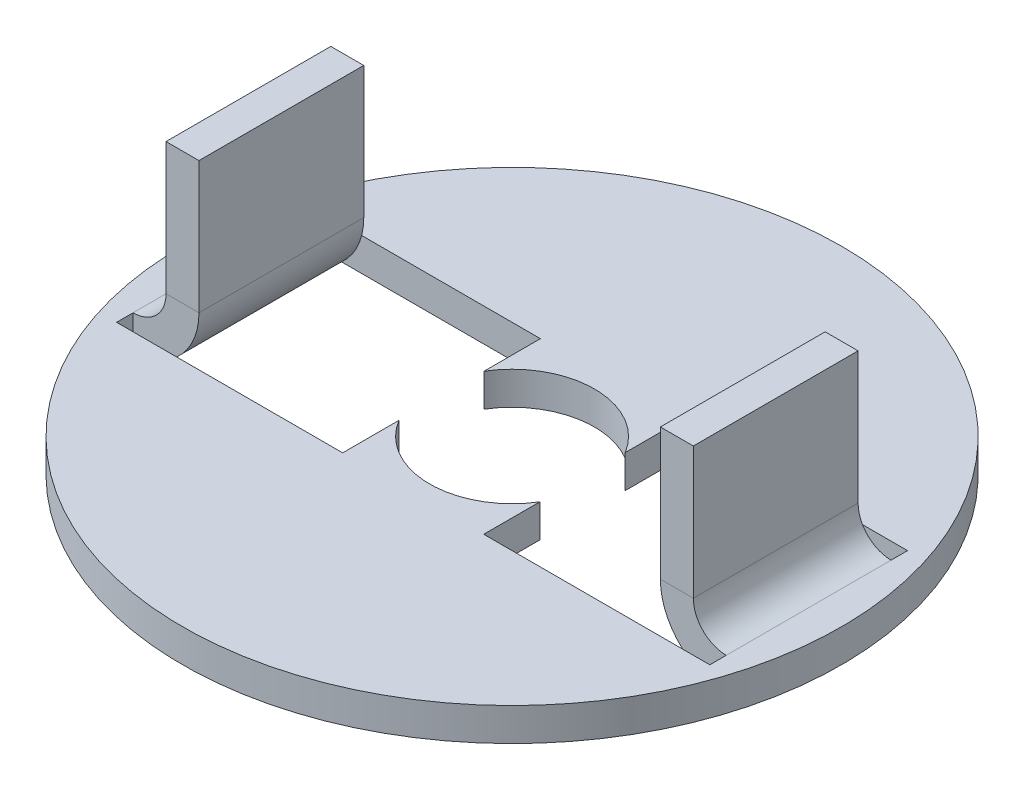
ISO-10303-21;
HEADER;
FILE_DESCRIPTION(('STEP AP214'),'2;1');
FILE_NAME('part.step','',(''),(''),'','','');
FILE_SCHEMA(('AUTOMOTIVE_DESIGN { 1 0 10303 214 1 1 1 1 }'));
ENDSEC;
DATA;
#1=APPLICATION_CONTEXT('core data for automotive mechanical design processes');
#2=APPLICATION_PROTOCOL_DEFINITION('international standard','automotive_design',2000,#1);
#3=PRODUCT_CONTEXT('',#1,'mechanical');
#4=PRODUCT('Part','Part','',(#3));
#5=PRODUCT_RELATED_PRODUCT_CATEGORY('part','',(#4));
#6=PRODUCT_DEFINITION_FORMATION('','',#4);
#7=PRODUCT_DEFINITION_CONTEXT('part definition',#1,'design');
#8=PRODUCT_DEFINITION('design','',#6,#7);
#9=PRODUCT_DEFINITION_SHAPE('','',#8);
#10=(LENGTH_UNIT() NAMED_UNIT(*) SI_UNIT(.MILLI.,.METRE.));
#11=(NAMED_UNIT(*) PLANE_ANGLE_UNIT() SI_UNIT($,.RADIAN.));
#12=(NAMED_UNIT(*) SI_UNIT($,.STERADIAN.) SOLID_ANGLE_UNIT());
#13=UNCERTAINTY_MEASURE_WITH_UNIT(LENGTH_MEASURE(1.E-05),#10,'distance_accuracy_value','');
#14=(GEOMETRIC_REPRESENTATION_CONTEXT(3) GLOBAL_UNCERTAINTY_ASSIGNED_CONTEXT((#13)) GLOBAL_UNIT_ASSIGNED_CONTEXT((#10,
#11,#12)) REPRESENTATION_CONTEXT('',''));
#15=CARTESIAN_POINT('',(0.,0.,0.));
#16=DIRECTION('',(0.,0.,1.));
#17=DIRECTION('',(1.,0.,0.));
#18=AXIS2_PLACEMENT_3D('',#15,#16,#17);
#19=CARTESIAN_POINT('',(-8.,0.999999999999999,2.5));
#20=DIRECTION('',(0.,0.,1.));
#21=DIRECTION('',(1.,0.,0.));
#22=AXIS2_PLACEMENT_3D('',#19,#20,#21);
#23=PLANE('',#22);
#24=DIRECTION('',(1.,0.,0.));
#25=VECTOR('',#24,1.);
#26=CARTESIAN_POINT('',(-8.,0.999999999999999,2.5));
#27=LINE('',#26,#25);
#28=CARTESIAN_POINT('',(-8.,0.999999999999999,2.5));
#29=VERTEX_POINT('',#28);
#30=CARTESIAN_POINT('',(-7.,0.999999999999999,2.5));
#31=VERTEX_POINT('',#30);
#32=EDGE_CURVE('E11',#29,#31,#27,.T.);
#33=ORIENTED_EDGE('',*,*,#32,.F.);
#34=CARTESIAN_POINT('',(-9.,0.999999999999999,2.5));
#35=DIRECTION('',(0.,0.,1.));
#36=DIRECTION('',(1.,0.,0.));
#37=AXIS2_PLACEMENT_3D('',#34,#35,#36);
#38=CIRCLE('',#37,1.);
#39=CARTESIAN_POINT('',(-9.,0.,2.5));
#40=VERTEX_POINT('',#39);
#41=EDGE_CURVE('E416',#29,#40,#38,.F.);
#42=ORIENTED_EDGE('',*,*,#41,.T.);
#43=DIRECTION('',(0.,1.,0.));
#44=VECTOR('',#43,1.);
#45=CARTESIAN_POINT('',(-9.,-1.,2.5));
#46=LINE('',#45,#44);
#47=CARTESIAN_POINT('',(-9.,-0.999999999999999,2.5));
#48=VERTEX_POINT('',#47);
#49=EDGE_CURVE('E49',#48,#40,#46,.T.);
#50=ORIENTED_EDGE('',*,*,#49,.F.);
#51=CARTESIAN_POINT('',(-9.,0.999999999999999,2.5));
#52=DIRECTION('',(0.,0.,1.));
#53=DIRECTION('',(1.,0.,0.));
#54=AXIS2_PLACEMENT_3D('',#51,#52,#53);
#55=CIRCLE('',#54,2.);
#56=EDGE_CURVE('E404',#31,#48,#55,.F.);
#57=ORIENTED_EDGE('',*,*,#56,.F.);
#58=EDGE_LOOP('',(#33,#42,#50,#57));
#59=FACE_BOUND('',#58,.T.);
#60=ADVANCED_FACE('F41',(#59),#23,.T.);
#61=CARTESIAN_POINT('',(-9.,-1.,2.5));
#62=DIRECTION('',(0.,0.,1.));
#63=DIRECTION('',(1.,0.,0.));
#64=AXIS2_PLACEMENT_3D('',#61,#62,#63);
#65=PLANE('',#64);
#66=DIRECTION('',(0.,-1.,0.));
#67=VECTOR('',#66,1.);
#68=CARTESIAN_POINT('',(-8.,5.,2.5));
#69=LINE('',#68,#67);
#70=CARTESIAN_POINT('',(-8.,5.,2.5));
#71=VERTEX_POINT('',#70);
#72=EDGE_CURVE('E414',#71,#29,#69,.T.);
#73=ORIENTED_EDGE('',*,*,#72,.T.);
#74=ORIENTED_EDGE('',*,*,#32,.T.);
#75=DIRECTION('',(0.,1.,0.));
#76=VECTOR('',#75,1.);
#77=CARTESIAN_POINT('',(-7.,5.,2.5));
#78=LINE('',#77,#76);
#79=CARTESIAN_POINT('',(-7.,5.,2.5));
#80=VERTEX_POINT('',#79);
#81=EDGE_CURVE('E407',#80,#31,#78,.F.);
#82=ORIENTED_EDGE('',*,*,#81,.F.);
#83=DIRECTION('',(1.,0.,0.));
#84=VECTOR('',#83,1.);
#85=CARTESIAN_POINT('',(-8.,5.,2.5));
#86=LINE('',#85,#84);
#87=EDGE_CURVE('E411',#71,#80,#86,.T.);
#88=ORIENTED_EDGE('',*,*,#87,.F.);
#89=EDGE_LOOP('',(#73,#74,#82,#88));
#90=FACE_BOUND('',#89,.T.);
#91=ADVANCED_FACE('F470',(#90),#65,.T.);
#92=CARTESIAN_POINT('',(-9.,0.,-2.5));
#93=DIRECTION('',(0.,0.,-1.));
#94=DIRECTION('',(-1.,0.,0.));
#95=AXIS2_PLACEMENT_3D('',#92,#93,#94);
#96=PLANE('',#95);
#97=DIRECTION('',(0.,-1.,0.));
#98=VECTOR('',#97,1.);
#99=CARTESIAN_POINT('',(-9.,0.,-2.5));
#100=LINE('',#99,#98);
#101=CARTESIAN_POINT('',(-9.,0.,-2.5));
#102=VERTEX_POINT('',#101);
#103=CARTESIAN_POINT('',(-9.,-1.,-2.5));
#104=VERTEX_POINT('',#103);
#105=EDGE_CURVE('E87',#102,#104,#100,.T.);
#106=ORIENTED_EDGE('',*,*,#105,.F.);
#107=CARTESIAN_POINT('',(-9.,0.999999999999999,-2.5));
#108=DIRECTION('',(0.,0.,1.));
#109=DIRECTION('',(1.,0.,0.));
#110=AXIS2_PLACEMENT_3D('',#107,#108,#109);
#111=CIRCLE('',#110,1.);
#112=CARTESIAN_POINT('',(-8.,0.999999999999999,-2.5));
#113=VERTEX_POINT('',#112);
#114=EDGE_CURVE('E408',#113,#102,#111,.F.);
#115=ORIENTED_EDGE('',*,*,#114,.F.);
#116=DIRECTION('',(-1.,0.,0.));
#117=VECTOR('',#116,1.);
#118=CARTESIAN_POINT('',(-7.,0.999999999999999,-2.5));
#119=LINE('',#118,#117);
#120=CARTESIAN_POINT('',(-7.,0.999999999999999,-2.5));
#121=VERTEX_POINT('',#120);
#122=EDGE_CURVE('E79',#121,#113,#119,.T.);
#123=ORIENTED_EDGE('',*,*,#122,.F.);
#124=CARTESIAN_POINT('',(-9.,0.999999999999999,-2.5));
#125=DIRECTION('',(0.,0.,1.));
#126=DIRECTION('',(1.,0.,0.));
#127=AXIS2_PLACEMENT_3D('',#124,#125,#126);
#128=CIRCLE('',#127,2.);
#129=EDGE_CURVE('E393',#121,#104,#128,.F.);
#130=ORIENTED_EDGE('',*,*,#129,.T.);
#131=EDGE_LOOP('',(#106,#115,#123,#130));
#132=FACE_BOUND('',#131,.T.);
#133=ADVANCED_FACE('F457',(#132),#96,.T.);
#134=CARTESIAN_POINT('',(-8.,0.,2.5));
#135=DIRECTION('',(0.,-1.,0.));
#136=DIRECTION('',(1.,0.,0.));
#137=AXIS2_PLACEMENT_3D('',#134,#135,#136);
#138=PLANE('',#137);
#139=CARTESIAN_POINT('',(0.,0.,0.));
#140=DIRECTION('',(0.,-1.,0.));
#141=DIRECTION('',(0.,0.,-1.));
#142=AXIS2_PLACEMENT_3D('',#139,#140,#141);
#143=CIRCLE('',#142,10.);
#144=CARTESIAN_POINT('',(0.,0.,-10.));
#145=VERTEX_POINT('',#144);
#146=EDGE_CURVE('E229',#145,#145,#143,.T.);
#147=ORIENTED_EDGE('',*,*,#146,.F.);
#148=EDGE_LOOP('',(#147));
#149=FACE_BOUND('',#148,.T.);
#150=DIRECTION('',(0.,0.,-1.));
#151=VECTOR('',#150,1.);
#152=CARTESIAN_POINT('',(2.13999999999996,0.,3.00000000000003));
#153=LINE('',#152,#151);
#154=CARTESIAN_POINT('',(2.13999999999996,0.,3.00000000000003));
#155=VERTEX_POINT('',#154);
#156=CARTESIAN_POINT('',(2.13999999999998,0.,1.29243955371231));
#157=VERTEX_POINT('',#156);
#158=EDGE_CURVE('E241',#155,#157,#153,.T.);
#159=ORIENTED_EDGE('',*,*,#158,.T.);
#160=CARTESIAN_POINT('',(0.,0.,0.));
#161=DIRECTION('',(0.,1.,0.));
#162=DIRECTION('',(0.,0.,-1.));
#163=AXIS2_PLACEMENT_3D('',#160,#161,#162);
#164=CIRCLE('',#163,2.5);
#165=CARTESIAN_POINT('',(-2.14,0.,1.29243955371228));
#166=VERTEX_POINT('',#165);
#167=EDGE_CURVE('E366',#166,#157,#164,.T.);
#168=ORIENTED_EDGE('',*,*,#167,.F.);
#169=DIRECTION('',(0.,0.,-1.));
#170=VECTOR('',#169,1.);
#171=CARTESIAN_POINT('',(-2.14,0.,3.));
#172=LINE('',#171,#170);
#173=CARTESIAN_POINT('',(-2.14,0.,3.));
#174=VERTEX_POINT('',#173);
#175=EDGE_CURVE('E363',#174,#166,#172,.T.);
#176=ORIENTED_EDGE('',*,*,#175,.F.);
#177=DIRECTION('',(1.,0.,0.));
#178=VECTOR('',#177,1.);
#179=CARTESIAN_POINT('',(-9.,0.,3.));
#180=LINE('',#179,#178);
#181=CARTESIAN_POINT('',(-9.,0.,3.));
#182=VERTEX_POINT('',#181);
#183=EDGE_CURVE('E360',#182,#174,#180,.T.);
#184=ORIENTED_EDGE('',*,*,#183,.F.);
#185=DIRECTION('',(0.,0.,1.));
#186=VECTOR('',#185,1.);
#187=CARTESIAN_POINT('',(-9.,0.,3.));
#188=LINE('',#187,#186);
#189=EDGE_CURVE('E356',#40,#182,#188,.T.);
#190=ORIENTED_EDGE('',*,*,#189,.F.);
#191=DIRECTION('',(0.,0.,-1.));
#192=VECTOR('',#191,1.);
#193=CARTESIAN_POINT('',(-9.,0.,2.5));
#194=LINE('',#193,#192);
#195=EDGE_CURVE('E418',#40,#102,#194,.T.);
#196=ORIENTED_EDGE('',*,*,#195,.T.);
#197=CARTESIAN_POINT('',(-9.,0.,-3.));
#198=VERTEX_POINT('',#197);
#199=EDGE_CURVE('E357',#198,#102,#188,.T.);
#200=ORIENTED_EDGE('',*,*,#199,.F.);
#201=DIRECTION('',(-1.,0.,0.));
#202=VECTOR('',#201,1.);
#203=CARTESIAN_POINT('',(-9.,0.,-3.));
#204=LINE('',#203,#202);
#205=CARTESIAN_POINT('',(-2.14,0.,-3.));
#206=VERTEX_POINT('',#205);
#207=EDGE_CURVE('E353',#206,#198,#204,.T.);
#208=ORIENTED_EDGE('',*,*,#207,.F.);
#209=DIRECTION('',(0.,0.,-1.));
#210=VECTOR('',#209,1.);
#211=CARTESIAN_POINT('',(-2.14,0.,-1.29243955371228));
#212=LINE('',#211,#210);
#213=CARTESIAN_POINT('',(-2.14,0.,-1.29243955371228));
#214=VERTEX_POINT('',#213);
#215=EDGE_CURVE('E226',#214,#206,#212,.T.);
#216=ORIENTED_EDGE('',*,*,#215,.F.);
#217=CARTESIAN_POINT('',(0.,0.,0.));
#218=DIRECTION('',(0.,1.,0.));
#219=DIRECTION('',(0.,0.,-1.));
#220=AXIS2_PLACEMENT_3D('',#217,#218,#219);
#221=CIRCLE('',#220,2.5);
#222=CARTESIAN_POINT('',(2.14000000000002,0.,-1.29243955371225));
#223=VERTEX_POINT('',#222);
#224=EDGE_CURVE('E217',#223,#214,#221,.T.);
#225=ORIENTED_EDGE('',*,*,#224,.F.);
#226=DIRECTION('',(0.,0.,-1.));
#227=VECTOR('',#226,1.);
#228=CARTESIAN_POINT('',(2.14000000000002,0.,-1.29243955371225));
#229=LINE('',#228,#227);
#230=CARTESIAN_POINT('',(2.14000000000004,0.,-2.99999999999997));
#231=VERTEX_POINT('',#230);
#232=EDGE_CURVE('E223',#223,#231,#229,.T.);
#233=ORIENTED_EDGE('',*,*,#232,.T.);
#234=DIRECTION('',(1.,0.,0.));
#235=VECTOR('',#234,1.);
#236=CARTESIAN_POINT('',(9.00000000000004,0.,-2.99999999999987));
#237=LINE('',#236,#235);
#238=CARTESIAN_POINT('',(9.00000000000004,0.,-2.99999999999987));
#239=VERTEX_POINT('',#238);
#240=EDGE_CURVE('E246',#231,#239,#237,.T.);
#241=ORIENTED_EDGE('',*,*,#240,.T.);
#242=DIRECTION('',(0.,0.,1.));
#243=VECTOR('',#242,1.);
#244=CARTESIAN_POINT('',(8.99999999999996,0.,3.00000000000012));
#245=LINE('',#244,#243);
#246=CARTESIAN_POINT('',(9.00000000000003,0.,-2.49999999999987));
#247=VERTEX_POINT('',#246);
#248=EDGE_CURVE('E257',#239,#247,#245,.T.);
#249=ORIENTED_EDGE('',*,*,#248,.T.);
#250=DIRECTION('',(0.,0.,-1.));
#251=VECTOR('',#250,1.);
#252=CARTESIAN_POINT('',(8.99999999999996,0.,2.50000000000013));
#253=LINE('',#252,#251);
#254=CARTESIAN_POINT('',(8.99999999999997,0.,2.50000000000013));
#255=VERTEX_POINT('',#254);
#256=EDGE_CURVE('E309',#255,#247,#253,.T.);
#257=ORIENTED_EDGE('',*,*,#256,.F.);
#258=CARTESIAN_POINT('',(8.99999999999996,0.,3.00000000000012));
#259=VERTEX_POINT('',#258);
#260=EDGE_CURVE('E250',#255,#259,#245,.T.);
#261=ORIENTED_EDGE('',*,*,#260,.T.);
#262=DIRECTION('',(-1.,0.,0.));
#263=VECTOR('',#262,1.);
#264=CARTESIAN_POINT('',(8.99999999999996,0.,3.00000000000012));
#265=LINE('',#264,#263);
#266=EDGE_CURVE('E260',#259,#155,#265,.T.);
#267=ORIENTED_EDGE('',*,*,#266,.T.);
#268=EDGE_LOOP('',(#159,#168,#176,#184,#190,#196,#200,#208,#216,#225,#233,#241,#249,#257,#261,#267));
#269=FACE_BOUND('',#268,.T.);
#270=ADVANCED_FACE('F220',(#149,#269),#138,.F.);
#271=CARTESIAN_POINT('',(-8.,-1.,2.5));
#272=DIRECTION('',(0.,-1.,0.));
#273=DIRECTION('',(1.,0.,0.));
#274=AXIS2_PLACEMENT_3D('',#271,#272,#273);
#275=PLANE('',#274);
#276=CARTESIAN_POINT('',(0.,-0.999999999999999,0.));
#277=DIRECTION('',(0.,-1.,0.));
#278=DIRECTION('',(0.,0.,-1.));
#279=AXIS2_PLACEMENT_3D('',#276,#277,#278);
#280=CIRCLE('',#279,10.);
#281=CARTESIAN_POINT('',(0.,-0.999999999999999,-10.));
#282=VERTEX_POINT('',#281);
#283=EDGE_CURVE('E348',#282,#282,#280,.T.);
#284=ORIENTED_EDGE('',*,*,#283,.T.);
#285=EDGE_LOOP('',(#284));
#286=FACE_BOUND('',#285,.T.);
#287=CARTESIAN_POINT('',(0.,-0.999999999999999,0.));
#288=DIRECTION('',(0.,1.,0.));
#289=DIRECTION('',(0.,0.,-1.));
#290=AXIS2_PLACEMENT_3D('',#287,#288,#289);
#291=CIRCLE('',#290,2.5);
#292=CARTESIAN_POINT('',(-2.14,-0.999999999999999,1.29243955371228));
#293=VERTEX_POINT('',#292);
#294=CARTESIAN_POINT('',(2.13999999999998,-0.999999999999999,1.29243955371231));
#295=VERTEX_POINT('',#294);
#296=EDGE_CURVE('E350',#293,#295,#291,.T.);
#297=ORIENTED_EDGE('',*,*,#296,.T.);
#298=DIRECTION('',(0.,0.,-1.));
#299=VECTOR('',#298,1.);
#300=CARTESIAN_POINT('',(2.13999999999996,-0.999999999999999,3.00000000000003));
#301=LINE('',#300,#299);
#302=CARTESIAN_POINT('',(2.13999999999996,-0.999999999999999,3.00000000000003));
#303=VERTEX_POINT('',#302);
#304=EDGE_CURVE('E247',#303,#295,#301,.T.);
#305=ORIENTED_EDGE('',*,*,#304,.F.);
#306=DIRECTION('',(-1.,0.,0.));
#307=VECTOR('',#306,1.);
#308=CARTESIAN_POINT('',(8.99999999999996,-0.999999999999999,3.00000000000012));
#309=LINE('',#308,#307);
#310=CARTESIAN_POINT('',(8.99999999999996,-0.999999999999999,3.00000000000012));
#311=VERTEX_POINT('',#310);
#312=EDGE_CURVE('E254',#311,#303,#309,.T.);
#313=ORIENTED_EDGE('',*,*,#312,.F.);
#314=DIRECTION('',(0.,0.,1.));
#315=VECTOR('',#314,1.);
#316=CARTESIAN_POINT('',(8.99999999999996,-0.999999999999999,3.00000000000012));
#317=LINE('',#316,#315);
#318=CARTESIAN_POINT('',(8.99999999999997,-0.999999999999999,2.50000000000013));
#319=VERTEX_POINT('',#318);
#320=EDGE_CURVE('E273',#319,#311,#317,.T.);
#321=ORIENTED_EDGE('',*,*,#320,.F.);
#322=DIRECTION('',(0.,0.,-1.));
#323=VECTOR('',#322,1.);
#324=CARTESIAN_POINT('',(8.99999999999996,-1.,2.50000000000013));
#325=LINE('',#324,#323);
#326=CARTESIAN_POINT('',(9.00000000000003,-1.,-2.49999999999987));
#327=VERTEX_POINT('',#326);
#328=EDGE_CURVE('E333',#319,#327,#325,.T.);
#329=ORIENTED_EDGE('',*,*,#328,.T.);
#330=CARTESIAN_POINT('',(9.00000000000004,-0.999999999999999,-2.99999999999987));
#331=VERTEX_POINT('',#330);
#332=EDGE_CURVE('E274',#331,#327,#317,.T.);
#333=ORIENTED_EDGE('',*,*,#332,.F.);
#334=DIRECTION('',(1.,0.,0.));
#335=VECTOR('',#334,1.);
#336=CARTESIAN_POINT('',(9.00000000000004,-0.999999999999999,-2.99999999999987));
#337=LINE('',#336,#335);
#338=CARTESIAN_POINT('',(2.14000000000004,-0.999999999999999,-2.99999999999997));
#339=VERTEX_POINT('',#338);
#340=EDGE_CURVE('E269',#339,#331,#337,.T.);
#341=ORIENTED_EDGE('',*,*,#340,.F.);
#342=DIRECTION('',(0.,0.,-1.));
#343=VECTOR('',#342,1.);
#344=CARTESIAN_POINT('',(2.14000000000002,-0.999999999999999,-1.29243955371225));
#345=LINE('',#344,#343);
#346=CARTESIAN_POINT('',(2.14000000000002,-0.999999999999999,-1.29243955371225));
#347=VERTEX_POINT('',#346);
#348=EDGE_CURVE('E266',#347,#339,#345,.T.);
#349=ORIENTED_EDGE('',*,*,#348,.F.);
#350=CARTESIAN_POINT('',(0.,-0.999999999999999,0.));
#351=DIRECTION('',(0.,1.,0.));
#352=DIRECTION('',(0.,0.,-1.));
#353=AXIS2_PLACEMENT_3D('',#350,#351,#352);
#354=CIRCLE('',#353,2.5);
#355=CARTESIAN_POINT('',(-2.14,-0.999999999999999,-1.29243955371228));
#356=VERTEX_POINT('',#355);
#357=EDGE_CURVE('E235',#347,#356,#354,.T.);
#358=ORIENTED_EDGE('',*,*,#357,.T.);
#359=DIRECTION('',(0.,0.,-1.));
#360=VECTOR('',#359,1.);
#361=CARTESIAN_POINT('',(-2.14,-0.999999999999999,-1.29243955371228));
#362=LINE('',#361,#360);
#363=CARTESIAN_POINT('',(-2.14,-0.999999999999999,-3.));
#364=VERTEX_POINT('',#363);
#365=EDGE_CURVE('E374',#356,#364,#362,.T.);
#366=ORIENTED_EDGE('',*,*,#365,.T.);
#367=DIRECTION('',(-1.,0.,0.));
#368=VECTOR('',#367,1.);
#369=CARTESIAN_POINT('',(-9.,-0.999999999999999,-3.));
#370=LINE('',#369,#368);
#371=CARTESIAN_POINT('',(-9.,-0.999999999999999,-3.));
#372=VERTEX_POINT('',#371);
#373=EDGE_CURVE('E377',#364,#372,#370,.T.);
#374=ORIENTED_EDGE('',*,*,#373,.T.);
#375=DIRECTION('',(0.,0.,1.));
#376=VECTOR('',#375,1.);
#377=CARTESIAN_POINT('',(-9.,-0.999999999999999,3.));
#378=LINE('',#377,#376);
#379=EDGE_CURVE('E381',#372,#104,#378,.T.);
#380=ORIENTED_EDGE('',*,*,#379,.T.);
#381=DIRECTION('',(0.,0.,-1.));
#382=VECTOR('',#381,1.);
#383=CARTESIAN_POINT('',(-9.,-1.,2.5));
#384=LINE('',#383,#382);
#385=EDGE_CURVE('E440',#48,#104,#384,.T.);
#386=ORIENTED_EDGE('',*,*,#385,.F.);
#387=CARTESIAN_POINT('',(-9.,-0.999999999999999,3.));
#388=VERTEX_POINT('',#387);
#389=EDGE_CURVE('E380',#48,#388,#378,.T.);
#390=ORIENTED_EDGE('',*,*,#389,.T.);
#391=DIRECTION('',(1.,0.,0.));
#392=VECTOR('',#391,1.);
#393=CARTESIAN_POINT('',(-9.,-0.999999999999999,3.));
#394=LINE('',#393,#392);
#395=CARTESIAN_POINT('',(-2.14,-0.999999999999999,3.));
#396=VERTEX_POINT('',#395);
#397=EDGE_CURVE('E384',#388,#396,#394,.T.);
#398=ORIENTED_EDGE('',*,*,#397,.T.);
#399=DIRECTION('',(0.,0.,-1.));
#400=VECTOR('',#399,1.);
#401=CARTESIAN_POINT('',(-2.14,-0.999999999999999,3.));
#402=LINE('',#401,#400);
#403=EDGE_CURVE('E387',#396,#293,#402,.T.);
#404=ORIENTED_EDGE('',*,*,#403,.T.);
#405=EDGE_LOOP('',(#297,#305,#313,#321,#329,#333,#341,#349,#358,#366,#374,#380,#386,#390,#398,#404));
#406=FACE_BOUND('',#405,.T.);
#407=ADVANCED_FACE('F492',(#286,#406),#275,.T.);
#408=CARTESIAN_POINT('',(-9.,0.999999999999999,2.5));
#409=DIRECTION('',(0.,0.,-1.));
#410=DIRECTION('',(-1.,0.,0.));
#411=AXIS2_PLACEMENT_3D('',#408,#409,#410);
#412=CYLINDRICAL_SURFACE('',#411,2.);
#413=ORIENTED_EDGE('',*,*,#129,.F.);
#414=DIRECTION('',(0.,0.,-1.));
#415=VECTOR('',#414,1.);
#416=CARTESIAN_POINT('',(-7.,0.999999999999999,2.5));
#417=LINE('',#416,#415);
#418=EDGE_CURVE('E437',#31,#121,#417,.T.);
#419=ORIENTED_EDGE('',*,*,#418,.F.);
#420=ORIENTED_EDGE('',*,*,#56,.T.);
#421=ORIENTED_EDGE('',*,*,#385,.T.);
#422=EDGE_LOOP('',(#413,#419,#420,#421));
#423=FACE_BOUND('',#422,.T.);
#424=ADVANCED_FACE('F463',(#423),#412,.T.);
#425=CARTESIAN_POINT('',(-7.,5.,2.5));
#426=DIRECTION('',(1.,0.,0.));
#427=DIRECTION('',(0.,0.,-1.));
#428=AXIS2_PLACEMENT_3D('',#425,#426,#427);
#429=PLANE('',#428);
#430=DIRECTION('',(0.,1.,0.));
#431=VECTOR('',#430,1.);
#432=CARTESIAN_POINT('',(-7.,5.,-2.5));
#433=LINE('',#432,#431);
#434=CARTESIAN_POINT('',(-7.,5.,-2.5));
#435=VERTEX_POINT('',#434);
#436=EDGE_CURVE('E420',#435,#121,#433,.F.);
#437=ORIENTED_EDGE('',*,*,#436,.F.);
#438=DIRECTION('',(0.,0.,-1.));
#439=VECTOR('',#438,1.);
#440=CARTESIAN_POINT('',(-7.,5.,2.5));
#441=LINE('',#440,#439);
#442=EDGE_CURVE('E435',#80,#435,#441,.T.);
#443=ORIENTED_EDGE('',*,*,#442,.F.);
#444=ORIENTED_EDGE('',*,*,#81,.T.);
#445=ORIENTED_EDGE('',*,*,#418,.T.);
#446=EDGE_LOOP('',(#437,#443,#444,#445));
#447=FACE_BOUND('',#446,.T.);
#448=ADVANCED_FACE('F461',(#447),#429,.T.);
#449=CARTESIAN_POINT('',(-8.,5.,2.5));
#450=DIRECTION('',(0.,1.,0.));
#451=DIRECTION('',(0.,0.,1.));
#452=AXIS2_PLACEMENT_3D('',#449,#450,#451);
#453=PLANE('',#452);
#454=DIRECTION('',(1.,0.,0.));
#455=VECTOR('',#454,1.);
#456=CARTESIAN_POINT('',(-8.,5.,-2.5));
#457=LINE('',#456,#455);
#458=CARTESIAN_POINT('',(-8.,5.,-2.5));
#459=VERTEX_POINT('',#458);
#460=EDGE_CURVE('E422',#459,#435,#457,.T.);
#461=ORIENTED_EDGE('',*,*,#460,.F.);
#462=DIRECTION('',(0.,0.,-1.));
#463=VECTOR('',#462,1.);
#464=CARTESIAN_POINT('',(-8.,5.,2.5));
#465=LINE('',#464,#463);
#466=EDGE_CURVE('E433',#71,#459,#465,.T.);
#467=ORIENTED_EDGE('',*,*,#466,.F.);
#468=ORIENTED_EDGE('',*,*,#87,.T.);
#469=ORIENTED_EDGE('',*,*,#442,.T.);
#470=EDGE_LOOP('',(#461,#467,#468,#469));
#471=FACE_BOUND('',#470,.T.);
#472=ADVANCED_FACE('F467',(#471),#453,.T.);
#473=CARTESIAN_POINT('',(-8.,5.,2.5));
#474=DIRECTION('',(1.,0.,0.));
#475=DIRECTION('',(0.,0.,-1.));
#476=AXIS2_PLACEMENT_3D('',#473,#474,#475);
#477=PLANE('',#476);
#478=DIRECTION('',(0.,-1.,0.));
#479=VECTOR('',#478,1.);
#480=CARTESIAN_POINT('',(-8.,5.,-2.5));
#481=LINE('',#480,#479);
#482=EDGE_CURVE('E425',#459,#113,#481,.T.);
#483=ORIENTED_EDGE('',*,*,#482,.T.);
#484=DIRECTION('',(0.,0.,-1.));
#485=VECTOR('',#484,1.);
#486=CARTESIAN_POINT('',(-8.,0.999999999999999,2.5));
#487=LINE('',#486,#485);
#488=EDGE_CURVE('E430',#29,#113,#487,.T.);
#489=ORIENTED_EDGE('',*,*,#488,.F.);
#490=ORIENTED_EDGE('',*,*,#72,.F.);
#491=ORIENTED_EDGE('',*,*,#466,.T.);
#492=EDGE_LOOP('',(#483,#489,#490,#491));
#493=FACE_BOUND('',#492,.T.);
#494=ADVANCED_FACE('F472',(#493),#477,.F.);
#495=CARTESIAN_POINT('',(-9.,0.999999999999999,2.5));
#496=DIRECTION('',(0.,0.,-1.));
#497=DIRECTION('',(-1.,0.,0.));
#498=AXIS2_PLACEMENT_3D('',#495,#496,#497);
#499=CYLINDRICAL_SURFACE('',#498,1.);
#500=ORIENTED_EDGE('',*,*,#114,.T.);
#501=ORIENTED_EDGE('',*,*,#195,.F.);
#502=ORIENTED_EDGE('',*,*,#41,.F.);
#503=ORIENTED_EDGE('',*,*,#488,.T.);
#504=EDGE_LOOP('',(#500,#501,#502,#503));
#505=FACE_BOUND('',#504,.T.);
#506=ADVANCED_FACE('F455',(#505),#499,.F.);
#507=CARTESIAN_POINT('',(-9.,0.999999999999999,-2.5));
#508=DIRECTION('',(0.,0.,1.));
#509=DIRECTION('',(1.,0.,0.));
#510=AXIS2_PLACEMENT_3D('',#507,#508,#509);
#511=PLANE('',#510);
#512=ORIENTED_EDGE('',*,*,#436,.T.);
#513=ORIENTED_EDGE('',*,*,#122,.T.);
#514=ORIENTED_EDGE('',*,*,#482,.F.);
#515=ORIENTED_EDGE('',*,*,#460,.T.);
#516=EDGE_LOOP('',(#512,#513,#514,#515));
#517=FACE_BOUND('',#516,.T.);
#518=ADVANCED_FACE('F464',(#517),#511,.F.);
#519=CARTESIAN_POINT('',(0.,0.,0.));
#520=DIRECTION('',(0.,-1.,0.));
#521=DIRECTION('',(0.,0.,-1.));
#522=AXIS2_PLACEMENT_3D('',#519,#520,#521);
#523=CYLINDRICAL_SURFACE('',#522,2.5);
#524=ORIENTED_EDGE('',*,*,#296,.F.);
#525=DIRECTION('',(0.,-1.,0.));
#526=VECTOR('',#525,1.);
#527=CARTESIAN_POINT('',(-2.14,0.,1.29243955371228));
#528=LINE('',#527,#526);
#529=EDGE_CURVE('E391',#166,#293,#528,.T.);
#530=ORIENTED_EDGE('',*,*,#529,.F.);
#531=ORIENTED_EDGE('',*,*,#167,.T.);
#532=DIRECTION('',(0.,-1.,0.));
#533=VECTOR('',#532,1.);
#534=CARTESIAN_POINT('',(2.13999999999998,0.,1.29243955371231));
#535=LINE('',#534,#533);
#536=EDGE_CURVE('E279',#157,#295,#535,.T.);
#537=ORIENTED_EDGE('',*,*,#536,.T.);
#538=EDGE_LOOP('',(#524,#530,#531,#537));
#539=FACE_BOUND('',#538,.T.);
#540=ADVANCED_FACE('F572',(#539),#523,.F.);
#541=CARTESIAN_POINT('',(-2.14,0.,3.));
#542=DIRECTION('',(-1.,0.,0.));
#543=DIRECTION('',(0.,0.,1.));
#544=AXIS2_PLACEMENT_3D('',#541,#542,#543);
#545=PLANE('',#544);
#546=ORIENTED_EDGE('',*,*,#403,.F.);
#547=DIRECTION('',(0.,-1.,0.));
#548=VECTOR('',#547,1.);
#549=CARTESIAN_POINT('',(-2.14,0.,3.));
#550=LINE('',#549,#548);
#551=EDGE_CURVE('E394',#174,#396,#550,.T.);
#552=ORIENTED_EDGE('',*,*,#551,.F.);
#553=ORIENTED_EDGE('',*,*,#175,.T.);
#554=ORIENTED_EDGE('',*,*,#529,.T.);
#555=EDGE_LOOP('',(#546,#552,#553,#554));
#556=FACE_BOUND('',#555,.T.);
#557=ADVANCED_FACE('F582',(#556),#545,.T.);
#558=CARTESIAN_POINT('',(-9.,0.,3.));
#559=DIRECTION('',(0.,0.,-1.));
#560=DIRECTION('',(-1.,0.,0.));
#561=AXIS2_PLACEMENT_3D('',#558,#559,#560);
#562=PLANE('',#561);
#563=ORIENTED_EDGE('',*,*,#397,.F.);
#564=DIRECTION('',(0.,-1.,0.));
#565=VECTOR('',#564,1.);
#566=CARTESIAN_POINT('',(-9.,0.,3.));
#567=LINE('',#566,#565);
#568=EDGE_CURVE('E396',#182,#388,#567,.T.);
#569=ORIENTED_EDGE('',*,*,#568,.F.);
#570=ORIENTED_EDGE('',*,*,#183,.T.);
#571=ORIENTED_EDGE('',*,*,#551,.T.);
#572=EDGE_LOOP('',(#563,#569,#570,#571));
#573=FACE_BOUND('',#572,.T.);
#574=ADVANCED_FACE('F592',(#573),#562,.T.);
#575=CARTESIAN_POINT('',(-9.,0.,3.));
#576=DIRECTION('',(1.,0.,0.));
#577=DIRECTION('',(0.,0.,-1.));
#578=AXIS2_PLACEMENT_3D('',#575,#576,#577);
#579=PLANE('',#578);
#580=ORIENTED_EDGE('',*,*,#389,.F.);
#581=ORIENTED_EDGE('',*,*,#49,.T.);
#582=ORIENTED_EDGE('',*,*,#189,.T.);
#583=ORIENTED_EDGE('',*,*,#568,.T.);
#584=EDGE_LOOP('',(#580,#581,#582,#583));
#585=FACE_BOUND('',#584,.T.);
#586=ADVANCED_FACE('F446',(#585),#579,.T.);
#587=CARTESIAN_POINT('',(0.,0.,0.));
#588=DIRECTION('',(0.,-1.,0.));
#589=DIRECTION('',(0.,0.,-1.));
#590=AXIS2_PLACEMENT_3D('',#587,#588,#589);
#591=CYLINDRICAL_SURFACE('',#590,10.);
#592=ORIENTED_EDGE('',*,*,#283,.F.);
#593=EDGE_LOOP('',(#592));
#594=FACE_BOUND('',#593,.T.);
#595=ORIENTED_EDGE('',*,*,#146,.T.);
#596=EDGE_LOOP('',(#595));
#597=FACE_BOUND('',#596,.T.);
#598=ADVANCED_FACE('F613',(#594,#597),#591,.T.);
#599=ORIENTED_EDGE('',*,*,#199,.T.);
#600=ORIENTED_EDGE('',*,*,#105,.T.);
#601=ORIENTED_EDGE('',*,*,#379,.F.);
#602=DIRECTION('',(0.,-1.,0.));
#603=VECTOR('',#602,1.);
#604=CARTESIAN_POINT('',(-9.,0.,-3.));
#605=LINE('',#604,#603);
#606=EDGE_CURVE('E399',#198,#372,#605,.T.);
#607=ORIENTED_EDGE('',*,*,#606,.F.);
#608=EDGE_LOOP('',(#599,#600,#601,#607));
#609=FACE_BOUND('',#608,.T.);
#610=ADVANCED_FACE('F615',(#609),#579,.T.);
#611=CARTESIAN_POINT('',(-9.,0.,-3.));
#612=DIRECTION('',(0.,0.,1.));
#613=DIRECTION('',(1.,0.,0.));
#614=AXIS2_PLACEMENT_3D('',#611,#612,#613);
#615=PLANE('',#614);
#616=ORIENTED_EDGE('',*,*,#373,.F.);
#617=DIRECTION('',(0.,-1.,0.));
#618=VECTOR('',#617,1.);
#619=CARTESIAN_POINT('',(-2.14,0.,-3.));
#620=LINE('',#619,#618);
#621=EDGE_CURVE('E401',#206,#364,#620,.T.);
#622=ORIENTED_EDGE('',*,*,#621,.F.);
#623=ORIENTED_EDGE('',*,*,#207,.T.);
#624=ORIENTED_EDGE('',*,*,#606,.T.);
#625=EDGE_LOOP('',(#616,#622,#623,#624));
#626=FACE_BOUND('',#625,.T.);
#627=ADVANCED_FACE('F624',(#626),#615,.T.);
#628=CARTESIAN_POINT('',(-2.14,0.,-1.29243955371228));
#629=DIRECTION('',(-1.,0.,0.));
#630=DIRECTION('',(0.,0.,1.));
#631=AXIS2_PLACEMENT_3D('',#628,#629,#630);
#632=PLANE('',#631);
#633=ORIENTED_EDGE('',*,*,#365,.F.);
#634=DIRECTION('',(0.,-1.,0.));
#635=VECTOR('',#634,1.);
#636=CARTESIAN_POINT('',(-2.14,0.,-1.29243955371228));
#637=LINE('',#636,#635);
#638=EDGE_CURVE('E369',#214,#356,#637,.T.);
#639=ORIENTED_EDGE('',*,*,#638,.F.);
#640=ORIENTED_EDGE('',*,*,#215,.T.);
#641=ORIENTED_EDGE('',*,*,#621,.T.);
#642=EDGE_LOOP('',(#633,#639,#640,#641));
#643=FACE_BOUND('',#642,.T.);
#644=ADVANCED_FACE('F634',(#643),#632,.T.);
#645=CARTESIAN_POINT('',(0.,0.,0.));
#646=DIRECTION('',(0.,-1.,0.));
#647=DIRECTION('',(0.,0.,-1.));
#648=AXIS2_PLACEMENT_3D('',#645,#646,#647);
#649=CYLINDRICAL_SURFACE('',#648,2.5);
#650=ORIENTED_EDGE('',*,*,#357,.F.);
#651=DIRECTION('',(0.,-1.,0.));
#652=VECTOR('',#651,1.);
#653=CARTESIAN_POINT('',(2.14000000000002,0.,-1.29243955371225));
#654=LINE('',#653,#652);
#655=EDGE_CURVE('E232',#223,#347,#654,.T.);
#656=ORIENTED_EDGE('',*,*,#655,.F.);
#657=ORIENTED_EDGE('',*,*,#224,.T.);
#658=ORIENTED_EDGE('',*,*,#638,.T.);
#659=EDGE_LOOP('',(#650,#656,#657,#658));
#660=FACE_BOUND('',#659,.T.);
#661=ADVANCED_FACE('F233',(#660),#649,.F.);
#662=CARTESIAN_POINT('',(7.99999999999997,0.999999999999999,2.50000000000011));
#663=DIRECTION('',(0.,0.,1.));
#664=DIRECTION('',(-1.,0.,0.));
#665=AXIS2_PLACEMENT_3D('',#662,#663,#664);
#666=PLANE('',#665);
#667=DIRECTION('',(-1.,0.,0.));
#668=VECTOR('',#667,1.);
#669=CARTESIAN_POINT('',(7.99999999999997,0.999999999999999,2.50000000000011));
#670=LINE('',#669,#668);
#671=CARTESIAN_POINT('',(7.99999999999997,0.999999999999999,2.50000000000011));
#672=VERTEX_POINT('',#671);
#673=CARTESIAN_POINT('',(6.99999999999996,0.999999999999999,2.5000000000001));
#674=VERTEX_POINT('',#673);
#675=EDGE_CURVE('E345',#672,#674,#670,.T.);
#676=ORIENTED_EDGE('',*,*,#675,.T.);
#677=CARTESIAN_POINT('',(8.99999999999996,0.999999999999999,2.50000000000013));
#678=DIRECTION('',(0.,0.,-1.));
#679=DIRECTION('',(-1.,0.,0.));
#680=AXIS2_PLACEMENT_3D('',#677,#678,#679);
#681=CIRCLE('',#680,2.);
#682=EDGE_CURVE('E293',#674,#319,#681,.F.);
#683=ORIENTED_EDGE('',*,*,#682,.T.);
#684=DIRECTION('',(0.,1.,0.));
#685=VECTOR('',#684,1.);
#686=CARTESIAN_POINT('',(8.99999999999996,-1.,2.50000000000013));
#687=LINE('',#686,#685);
#688=EDGE_CURVE('E342',#319,#255,#687,.T.);
#689=ORIENTED_EDGE('',*,*,#688,.T.);
#690=CARTESIAN_POINT('',(8.99999999999996,0.999999999999999,2.50000000000013));
#691=DIRECTION('',(0.,0.,-1.));
#692=DIRECTION('',(-1.,0.,0.));
#693=AXIS2_PLACEMENT_3D('',#690,#691,#692);
#694=CIRCLE('',#693,1.);
#695=EDGE_CURVE('E306',#672,#255,#694,.F.);
#696=ORIENTED_EDGE('',*,*,#695,.F.);
#697=EDGE_LOOP('',(#676,#683,#689,#696));
#698=FACE_BOUND('',#697,.T.);
#699=ADVANCED_FACE('F655',(#698),#666,.T.);
#700=CARTESIAN_POINT('',(8.99999999999996,-1.,2.50000000000013));
#701=DIRECTION('',(0.,0.,1.));
#702=DIRECTION('',(-1.,0.,0.));
#703=AXIS2_PLACEMENT_3D('',#700,#701,#702);
#704=PLANE('',#703);
#705=DIRECTION('',(0.,-1.,0.));
#706=VECTOR('',#705,1.);
#707=CARTESIAN_POINT('',(7.99999999999997,5.,2.50000000000011));
#708=LINE('',#707,#706);
#709=CARTESIAN_POINT('',(7.99999999999997,5.,2.50000000000011));
#710=VERTEX_POINT('',#709);
#711=EDGE_CURVE('E303',#710,#672,#708,.T.);
#712=ORIENTED_EDGE('',*,*,#711,.F.);
#713=DIRECTION('',(-1.,0.,0.));
#714=VECTOR('',#713,1.);
#715=CARTESIAN_POINT('',(7.99999999999997,5.,2.50000000000011));
#716=LINE('',#715,#714);
#717=CARTESIAN_POINT('',(6.99999999999997,5.,2.5000000000001));
#718=VERTEX_POINT('',#717);
#719=EDGE_CURVE('E300',#710,#718,#716,.T.);
#720=ORIENTED_EDGE('',*,*,#719,.T.);
#721=DIRECTION('',(0.,1.,0.));
#722=VECTOR('',#721,1.);
#723=CARTESIAN_POINT('',(6.99999999999997,5.,2.5000000000001));
#724=LINE('',#723,#722);
#725=EDGE_CURVE('E296',#718,#674,#724,.F.);
#726=ORIENTED_EDGE('',*,*,#725,.T.);
#727=ORIENTED_EDGE('',*,*,#675,.F.);
#728=EDGE_LOOP('',(#712,#720,#726,#727));
#729=FACE_BOUND('',#728,.T.);
#730=ADVANCED_FACE('F667',(#729),#704,.T.);
#731=CARTESIAN_POINT('',(9.00000000000003,0.,-2.49999999999987));
#732=DIRECTION('',(0.,0.,-1.));
#733=DIRECTION('',(1.,0.,0.));
#734=AXIS2_PLACEMENT_3D('',#731,#732,#733);
#735=PLANE('',#734);
#736=DIRECTION('',(0.,-1.,0.));
#737=VECTOR('',#736,1.);
#738=CARTESIAN_POINT('',(9.00000000000003,0.,-2.49999999999987));
#739=LINE('',#738,#737);
#740=EDGE_CURVE('E339',#247,#327,#739,.T.);
#741=ORIENTED_EDGE('',*,*,#740,.T.);
#742=CARTESIAN_POINT('',(9.00000000000003,0.999999999999999,-2.49999999999987));
#743=DIRECTION('',(0.,0.,-1.));
#744=DIRECTION('',(-1.,0.,0.));
#745=AXIS2_PLACEMENT_3D('',#742,#743,#744);
#746=CIRCLE('',#745,2.);
#747=CARTESIAN_POINT('',(7.00000000000003,0.999999999999999,-2.4999999999999));
#748=VERTEX_POINT('',#747);
#749=EDGE_CURVE('E283',#748,#327,#746,.F.);
#750=ORIENTED_EDGE('',*,*,#749,.F.);
#751=DIRECTION('',(1.,0.,0.));
#752=VECTOR('',#751,1.);
#753=CARTESIAN_POINT('',(7.00000000000003,0.999999999999999,-2.4999999999999));
#754=LINE('',#753,#752);
#755=CARTESIAN_POINT('',(8.00000000000004,0.999999999999999,-2.49999999999989));
#756=VERTEX_POINT('',#755);
#757=EDGE_CURVE('E336',#748,#756,#754,.T.);
#758=ORIENTED_EDGE('',*,*,#757,.T.);
#759=CARTESIAN_POINT('',(9.00000000000003,0.999999999999999,-2.49999999999987));
#760=DIRECTION('',(0.,0.,-1.));
#761=DIRECTION('',(-1.,0.,0.));
#762=AXIS2_PLACEMENT_3D('',#759,#760,#761);
#763=CIRCLE('',#762,1.);
#764=EDGE_CURVE('E297',#756,#247,#763,.F.);
#765=ORIENTED_EDGE('',*,*,#764,.T.);
#766=EDGE_LOOP('',(#741,#750,#758,#765));
#767=FACE_BOUND('',#766,.T.);
#768=ADVANCED_FACE('F674',(#767),#735,.T.);
#769=CARTESIAN_POINT('',(8.99999999999996,0.999999999999999,2.50000000000013));
#770=DIRECTION('',(0.,0.,-1.));
#771=DIRECTION('',(1.,0.,0.));
#772=AXIS2_PLACEMENT_3D('',#769,#770,#771);
#773=CYLINDRICAL_SURFACE('',#772,2.);
#774=ORIENTED_EDGE('',*,*,#749,.T.);
#775=ORIENTED_EDGE('',*,*,#328,.F.);
#776=ORIENTED_EDGE('',*,*,#682,.F.);
#777=DIRECTION('',(0.,0.,-1.));
#778=VECTOR('',#777,1.);
#779=CARTESIAN_POINT('',(6.99999999999996,0.999999999999999,2.5000000000001));
#780=LINE('',#779,#778);
#781=EDGE_CURVE('E330',#674,#748,#780,.T.);
#782=ORIENTED_EDGE('',*,*,#781,.T.);
#783=EDGE_LOOP('',(#774,#775,#776,#782));
#784=FACE_BOUND('',#783,.T.);
#785=ADVANCED_FACE('F690',(#784),#773,.T.);
#786=CARTESIAN_POINT('',(6.99999999999997,5.,2.5000000000001));
#787=DIRECTION('',(-1.,0.,0.));
#788=DIRECTION('',(0.,0.,-1.));
#789=AXIS2_PLACEMENT_3D('',#786,#787,#788);
#790=PLANE('',#789);
#791=DIRECTION('',(0.,1.,0.));
#792=VECTOR('',#791,1.);
#793=CARTESIAN_POINT('',(7.00000000000003,5.,-2.4999999999999));
#794=LINE('',#793,#792);
#795=CARTESIAN_POINT('',(7.00000000000003,5.,-2.4999999999999));
#796=VERTEX_POINT('',#795);
#797=EDGE_CURVE('E312',#796,#748,#794,.F.);
#798=ORIENTED_EDGE('',*,*,#797,.T.);
#799=ORIENTED_EDGE('',*,*,#781,.F.);
#800=ORIENTED_EDGE('',*,*,#725,.F.);
#801=DIRECTION('',(0.,0.,-1.));
#802=VECTOR('',#801,1.);
#803=CARTESIAN_POINT('',(6.99999999999997,5.,2.5000000000001));
#804=LINE('',#803,#802);
#805=EDGE_CURVE('E327',#718,#796,#804,.T.);
#806=ORIENTED_EDGE('',*,*,#805,.T.);
#807=EDGE_LOOP('',(#798,#799,#800,#806));
#808=FACE_BOUND('',#807,.T.);
#809=ADVANCED_FACE('F682',(#808),#790,.T.);
#810=CARTESIAN_POINT('',(7.99999999999997,5.,2.50000000000011));
#811=DIRECTION('',(0.,1.,0.));
#812=DIRECTION('',(0.,0.,1.));
#813=AXIS2_PLACEMENT_3D('',#810,#811,#812);
#814=PLANE('',#813);
#815=DIRECTION('',(-1.,0.,0.));
#816=VECTOR('',#815,1.);
#817=CARTESIAN_POINT('',(8.00000000000004,5.,-2.49999999999989));
#818=LINE('',#817,#816);
#819=CARTESIAN_POINT('',(8.00000000000004,5.,-2.49999999999989));
#820=VERTEX_POINT('',#819);
#821=EDGE_CURVE('E314',#820,#796,#818,.T.);
#822=ORIENTED_EDGE('',*,*,#821,.T.);
#823=ORIENTED_EDGE('',*,*,#805,.F.);
#824=ORIENTED_EDGE('',*,*,#719,.F.);
#825=DIRECTION('',(0.,0.,-1.));
#826=VECTOR('',#825,1.);
#827=CARTESIAN_POINT('',(7.99999999999997,5.,2.50000000000011));
#828=LINE('',#827,#826);
#829=EDGE_CURVE('E324',#710,#820,#828,.T.);
#830=ORIENTED_EDGE('',*,*,#829,.T.);
#831=EDGE_LOOP('',(#822,#823,#824,#830));
#832=FACE_BOUND('',#831,.T.);
#833=ADVANCED_FACE('F689',(#832),#814,.T.);
#834=CARTESIAN_POINT('',(7.99999999999997,5.,2.50000000000011));
#835=DIRECTION('',(-1.,0.,0.));
#836=DIRECTION('',(0.,0.,-1.));
#837=AXIS2_PLACEMENT_3D('',#834,#835,#836);
#838=PLANE('',#837);
#839=DIRECTION('',(0.,-1.,0.));
#840=VECTOR('',#839,1.);
#841=CARTESIAN_POINT('',(8.00000000000004,5.,-2.49999999999989));
#842=LINE('',#841,#840);
#843=EDGE_CURVE('E316',#820,#756,#842,.T.);
#844=ORIENTED_EDGE('',*,*,#843,.F.);
#845=ORIENTED_EDGE('',*,*,#829,.F.);
#846=ORIENTED_EDGE('',*,*,#711,.T.);
#847=DIRECTION('',(0.,0.,-1.));
#848=VECTOR('',#847,1.);
#849=CARTESIAN_POINT('',(7.99999999999997,0.999999999999999,2.50000000000011));
#850=LINE('',#849,#848);
#851=EDGE_CURVE('E322',#672,#756,#850,.T.);
#852=ORIENTED_EDGE('',*,*,#851,.T.);
#853=EDGE_LOOP('',(#844,#845,#846,#852));
#854=FACE_BOUND('',#853,.T.);
#855=ADVANCED_FACE('F703',(#854),#838,.F.);
#856=CARTESIAN_POINT('',(8.99999999999996,0.999999999999999,2.50000000000013));
#857=DIRECTION('',(0.,0.,-1.));
#858=DIRECTION('',(1.,0.,0.));
#859=AXIS2_PLACEMENT_3D('',#856,#857,#858);
#860=CYLINDRICAL_SURFACE('',#859,1.);
#861=ORIENTED_EDGE('',*,*,#764,.F.);
#862=ORIENTED_EDGE('',*,*,#851,.F.);
#863=ORIENTED_EDGE('',*,*,#695,.T.);
#864=ORIENTED_EDGE('',*,*,#256,.T.);
#865=EDGE_LOOP('',(#861,#862,#863,#864));
#866=FACE_BOUND('',#865,.T.);
#867=ADVANCED_FACE('F714',(#866),#860,.F.);
#868=CARTESIAN_POINT('',(9.00000000000003,0.999999999999999,-2.49999999999987));
#869=DIRECTION('',(0.,0.,1.));
#870=DIRECTION('',(-1.,0.,0.));
#871=AXIS2_PLACEMENT_3D('',#868,#869,#870);
#872=PLANE('',#871);
#873=ORIENTED_EDGE('',*,*,#797,.F.);
#874=ORIENTED_EDGE('',*,*,#821,.F.);
#875=ORIENTED_EDGE('',*,*,#843,.T.);
#876=ORIENTED_EDGE('',*,*,#757,.F.);
#877=EDGE_LOOP('',(#873,#874,#875,#876));
#878=FACE_BOUND('',#877,.T.);
#879=ADVANCED_FACE('F721',(#878),#872,.F.);
#880=CARTESIAN_POINT('',(2.13999999999996,0.,3.00000000000003));
#881=DIRECTION('',(1.,0.,0.));
#882=DIRECTION('',(0.,0.,1.));
#883=AXIS2_PLACEMENT_3D('',#880,#881,#882);
#884=PLANE('',#883);
#885=ORIENTED_EDGE('',*,*,#304,.T.);
#886=ORIENTED_EDGE('',*,*,#536,.F.);
#887=ORIENTED_EDGE('',*,*,#158,.F.);
#888=DIRECTION('',(0.,-1.,0.));
#889=VECTOR('',#888,1.);
#890=CARTESIAN_POINT('',(2.13999999999996,0.,3.00000000000003));
#891=LINE('',#890,#889);
#892=EDGE_CURVE('E284',#155,#303,#891,.T.);
#893=ORIENTED_EDGE('',*,*,#892,.T.);
#894=EDGE_LOOP('',(#885,#886,#887,#893));
#895=FACE_BOUND('',#894,.T.);
#896=ADVANCED_FACE('F728',(#895),#884,.T.);
#897=CARTESIAN_POINT('',(8.99999999999996,0.,3.00000000000012));
#898=DIRECTION('',(0.,0.,-1.));
#899=DIRECTION('',(1.,0.,0.));
#900=AXIS2_PLACEMENT_3D('',#897,#898,#899);
#901=PLANE('',#900);
#902=ORIENTED_EDGE('',*,*,#312,.T.);
#903=ORIENTED_EDGE('',*,*,#892,.F.);
#904=ORIENTED_EDGE('',*,*,#266,.F.);
#905=DIRECTION('',(0.,-1.,0.));
#906=VECTOR('',#905,1.);
#907=CARTESIAN_POINT('',(8.99999999999996,0.,3.00000000000012));
#908=LINE('',#907,#906);
#909=EDGE_CURVE('E287',#259,#311,#908,.T.);
#910=ORIENTED_EDGE('',*,*,#909,.T.);
#911=EDGE_LOOP('',(#902,#903,#904,#910));
#912=FACE_BOUND('',#911,.T.);
#913=ADVANCED_FACE('F739',(#912),#901,.T.);
#914=CARTESIAN_POINT('',(8.99999999999996,0.,3.00000000000012));
#915=DIRECTION('',(-1.,0.,0.));
#916=DIRECTION('',(0.,0.,-1.));
#917=AXIS2_PLACEMENT_3D('',#914,#915,#916);
#918=PLANE('',#917);
#919=ORIENTED_EDGE('',*,*,#320,.T.);
#920=ORIENTED_EDGE('',*,*,#909,.F.);
#921=ORIENTED_EDGE('',*,*,#260,.F.);
#922=ORIENTED_EDGE('',*,*,#688,.F.);
#923=EDGE_LOOP('',(#919,#920,#921,#922));
#924=FACE_BOUND('',#923,.T.);
#925=ADVANCED_FACE('F750',(#924),#918,.T.);
#926=ORIENTED_EDGE('',*,*,#248,.F.);
#927=DIRECTION('',(0.,-1.,0.));
#928=VECTOR('',#927,1.);
#929=CARTESIAN_POINT('',(9.00000000000004,0.,-2.99999999999987));
#930=LINE('',#929,#928);
#931=EDGE_CURVE('E289',#239,#331,#930,.T.);
#932=ORIENTED_EDGE('',*,*,#931,.T.);
#933=ORIENTED_EDGE('',*,*,#332,.T.);
#934=ORIENTED_EDGE('',*,*,#740,.F.);
#935=EDGE_LOOP('',(#926,#932,#933,#934));
#936=FACE_BOUND('',#935,.T.);
#937=ADVANCED_FACE('F761',(#936),#918,.T.);
#938=CARTESIAN_POINT('',(9.00000000000004,0.,-2.99999999999987));
#939=DIRECTION('',(0.,0.,1.));
#940=DIRECTION('',(-1.,0.,0.));
#941=AXIS2_PLACEMENT_3D('',#938,#939,#940);
#942=PLANE('',#941);
#943=ORIENTED_EDGE('',*,*,#340,.T.);
#944=ORIENTED_EDGE('',*,*,#931,.F.);
#945=ORIENTED_EDGE('',*,*,#240,.F.);
#946=DIRECTION('',(0.,-1.,0.));
#947=VECTOR('',#946,1.);
#948=CARTESIAN_POINT('',(2.14000000000004,0.,-2.99999999999997));
#949=LINE('',#948,#947);
#950=EDGE_CURVE('E240',#231,#339,#949,.T.);
#951=ORIENTED_EDGE('',*,*,#950,.T.);
#952=EDGE_LOOP('',(#943,#944,#945,#951));
#953=FACE_BOUND('',#952,.T.);
#954=ADVANCED_FACE('F772',(#953),#942,.T.);
#955=CARTESIAN_POINT('',(2.14000000000002,0.,-1.29243955371225));
#956=DIRECTION('',(1.,0.,0.));
#957=DIRECTION('',(0.,0.,1.));
#958=AXIS2_PLACEMENT_3D('',#955,#956,#957);
#959=PLANE('',#958);
#960=ORIENTED_EDGE('',*,*,#348,.T.);
#961=ORIENTED_EDGE('',*,*,#950,.F.);
#962=ORIENTED_EDGE('',*,*,#232,.F.);
#963=ORIENTED_EDGE('',*,*,#655,.T.);
#964=EDGE_LOOP('',(#960,#961,#962,#963));
#965=FACE_BOUND('',#964,.T.);
#966=ADVANCED_FACE('F243',(#965),#959,.T.);
#967=CLOSED_SHELL('',(#60,#91,#133,#270,#407,#424,#448,#472,#494,#506,#518,#540,#557,#574,#586,
#598,#610,#627,#644,#661,#699,#730,#768,#785,#809,#833,#855,#867,#879,#896,#913,#925,#937,#954,#966));
#968=MANIFOLD_SOLID_BREP('B2',#967);
#969=ADVANCED_BREP_SHAPE_REPRESENTATION('',(#18,#968),#14);
#970=SHAPE_DEFINITION_REPRESENTATION(#9,#969);
ENDSEC;
END-ISO-10303-21;
